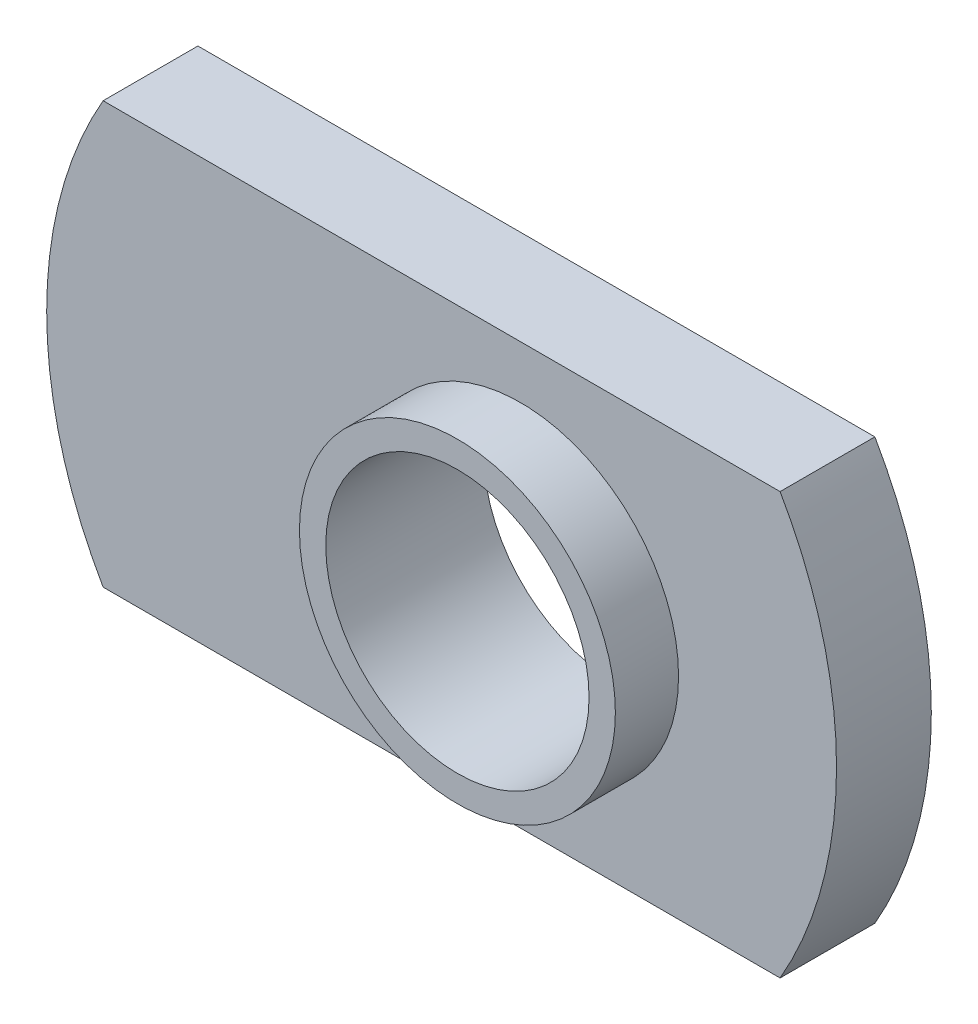
ISO-10303-21;
HEADER;
FILE_DESCRIPTION(('STEP AP214'),'2;1');
FILE_NAME('part.step','',(''),(''),'','','');
FILE_SCHEMA(('AUTOMOTIVE_DESIGN { 1 0 10303 214 1 1 1 1 }'));
ENDSEC;
DATA;
#1=APPLICATION_CONTEXT('core data for automotive mechanical design processes');
#2=APPLICATION_PROTOCOL_DEFINITION('international standard','automotive_design',2000,#1);
#3=PRODUCT_CONTEXT('',#1,'mechanical');
#4=PRODUCT('Part','Part','',(#3));
#5=PRODUCT_RELATED_PRODUCT_CATEGORY('part','',(#4));
#6=PRODUCT_DEFINITION_FORMATION('','',#4);
#7=PRODUCT_DEFINITION_CONTEXT('part definition',#1,'design');
#8=PRODUCT_DEFINITION('design','',#6,#7);
#9=PRODUCT_DEFINITION_SHAPE('','',#8);
#10=(LENGTH_UNIT() NAMED_UNIT(*) SI_UNIT(.MILLI.,.METRE.));
#11=(NAMED_UNIT(*) PLANE_ANGLE_UNIT() SI_UNIT($,.RADIAN.));
#12=(NAMED_UNIT(*) SI_UNIT($,.STERADIAN.) SOLID_ANGLE_UNIT());
#13=UNCERTAINTY_MEASURE_WITH_UNIT(LENGTH_MEASURE(1.E-05),#10,'distance_accuracy_value','');
#14=(GEOMETRIC_REPRESENTATION_CONTEXT(3) GLOBAL_UNCERTAINTY_ASSIGNED_CONTEXT((#13)) GLOBAL_UNIT_ASSIGNED_CONTEXT((#10,
#11,#12)) REPRESENTATION_CONTEXT('',''));
#15=CARTESIAN_POINT('',(0.,0.,0.));
#16=DIRECTION('',(0.,0.,1.));
#17=DIRECTION('',(1.,0.,0.));
#18=AXIS2_PLACEMENT_3D('',#15,#16,#17);
#19=CARTESIAN_POINT('',(-1.,0.,0.9));
#20=DIRECTION('',(0.,0.,-1.));
#21=DIRECTION('',(-1.,0.,0.));
#22=AXIS2_PLACEMENT_3D('',#19,#20,#21);
#23=CYLINDRICAL_SURFACE('',#22,8.);
#24=CARTESIAN_POINT('',(-1.,0.,-0.9));
#25=DIRECTION('',(0.,0.,1.));
#26=DIRECTION('',(-1.,0.,0.));
#27=AXIS2_PLACEMENT_3D('',#24,#25,#26);
#28=CIRCLE('',#27,8.);
#29=CARTESIAN_POINT('',(-7.92820323027551,4.,-0.9));
#30=VERTEX_POINT('',#29);
#31=CARTESIAN_POINT('',(-7.92820323027551,-4.,-0.9));
#32=VERTEX_POINT('',#31);
#33=EDGE_CURVE('E110',#30,#32,#28,.T.);
#34=ORIENTED_EDGE('',*,*,#33,.T.);
#35=DIRECTION('',(0.,0.,-1.));
#36=VECTOR('',#35,1.);
#37=CARTESIAN_POINT('',(-7.92820323027551,-4.,0.9));
#38=LINE('',#37,#36);
#39=CARTESIAN_POINT('',(-7.92820323027551,-4.,0.9));
#40=VERTEX_POINT('',#39);
#41=EDGE_CURVE('E48',#40,#32,#38,.T.);
#42=ORIENTED_EDGE('',*,*,#41,.F.);
#43=CARTESIAN_POINT('',(-1.,0.,0.9));
#44=DIRECTION('',(0.,0.,1.));
#45=DIRECTION('',(-1.,0.,0.));
#46=AXIS2_PLACEMENT_3D('',#43,#44,#45);
#47=CIRCLE('',#46,8.);
#48=CARTESIAN_POINT('',(-7.92820323027551,4.,0.9));
#49=VERTEX_POINT('',#48);
#50=EDGE_CURVE('E92',#49,#40,#47,.T.);
#51=ORIENTED_EDGE('',*,*,#50,.F.);
#52=DIRECTION('',(0.,0.,-1.));
#53=VECTOR('',#52,1.);
#54=CARTESIAN_POINT('',(-7.92820323027551,4.,0.9));
#55=LINE('',#54,#53);
#56=EDGE_CURVE('E106',#49,#30,#55,.T.);
#57=ORIENTED_EDGE('',*,*,#56,.T.);
#58=EDGE_LOOP('',(#34,#42,#51,#57));
#59=FACE_BOUND('',#58,.T.);
#60=ADVANCED_FACE('F39',(#59),#23,.T.);
#61=CARTESIAN_POINT('',(-7.92820323027551,-4.,0.9));
#62=DIRECTION('',(0.,1.,0.));
#63=DIRECTION('',(-1.,0.,0.));
#64=AXIS2_PLACEMENT_3D('',#61,#62,#63);
#65=PLANE('',#64);
#66=DIRECTION('',(1.,0.,0.));
#67=VECTOR('',#66,1.);
#68=CARTESIAN_POINT('',(-7.92820323027551,-4.,-0.9));
#69=LINE('',#68,#67);
#70=CARTESIAN_POINT('',(4.92820323027551,-4.,-0.9));
#71=VERTEX_POINT('',#70);
#72=EDGE_CURVE('E98',#32,#71,#69,.T.);
#73=ORIENTED_EDGE('',*,*,#72,.T.);
#74=DIRECTION('',(0.,0.,-1.));
#75=VECTOR('',#74,1.);
#76=CARTESIAN_POINT('',(4.92820323027551,-4.,0.9));
#77=LINE('',#76,#75);
#78=CARTESIAN_POINT('',(4.92820323027551,-4.,0.9));
#79=VERTEX_POINT('',#78);
#80=EDGE_CURVE('E96',#79,#71,#77,.T.);
#81=ORIENTED_EDGE('',*,*,#80,.F.);
#82=DIRECTION('',(1.,0.,0.));
#83=VECTOR('',#82,1.);
#84=CARTESIAN_POINT('',(-7.92820323027551,-4.,0.9));
#85=LINE('',#84,#83);
#86=EDGE_CURVE('E87',#40,#79,#85,.T.);
#87=ORIENTED_EDGE('',*,*,#86,.F.);
#88=ORIENTED_EDGE('',*,*,#41,.T.);
#89=EDGE_LOOP('',(#73,#81,#87,#88));
#90=FACE_BOUND('',#89,.T.);
#91=ADVANCED_FACE('F97',(#90),#65,.F.);
#92=CARTESIAN_POINT('',(-2.,0.,0.9));
#93=DIRECTION('',(0.,0.,-1.));
#94=DIRECTION('',(-1.,0.,0.));
#95=AXIS2_PLACEMENT_3D('',#92,#93,#94);
#96=CYLINDRICAL_SURFACE('',#95,8.);
#97=CARTESIAN_POINT('',(-2.,0.,-0.9));
#98=DIRECTION('',(0.,0.,1.));
#99=DIRECTION('',(1.,0.,0.));
#100=AXIS2_PLACEMENT_3D('',#97,#98,#99);
#101=CIRCLE('',#100,8.);
#102=CARTESIAN_POINT('',(4.92820323027551,4.,-0.9));
#103=VERTEX_POINT('',#102);
#104=EDGE_CURVE('E73',#71,#103,#101,.T.);
#105=ORIENTED_EDGE('',*,*,#104,.T.);
#106=DIRECTION('',(0.,0.,-1.));
#107=VECTOR('',#106,1.);
#108=CARTESIAN_POINT('',(4.92820323027551,4.,0.9));
#109=LINE('',#108,#107);
#110=CARTESIAN_POINT('',(4.92820323027551,4.,0.9));
#111=VERTEX_POINT('',#110);
#112=EDGE_CURVE('E100',#111,#103,#109,.T.);
#113=ORIENTED_EDGE('',*,*,#112,.F.);
#114=CARTESIAN_POINT('',(-2.,0.,0.9));
#115=DIRECTION('',(0.,0.,1.));
#116=DIRECTION('',(1.,0.,0.));
#117=AXIS2_PLACEMENT_3D('',#114,#115,#116);
#118=CIRCLE('',#117,8.);
#119=EDGE_CURVE('E90',#79,#111,#118,.T.);
#120=ORIENTED_EDGE('',*,*,#119,.F.);
#121=ORIENTED_EDGE('',*,*,#80,.T.);
#122=EDGE_LOOP('',(#105,#113,#120,#121));
#123=FACE_BOUND('',#122,.T.);
#124=ADVANCED_FACE('F102',(#123),#96,.T.);
#125=CARTESIAN_POINT('',(-7.92820323027551,4.,0.9));
#126=DIRECTION('',(0.,-1.,0.));
#127=DIRECTION('',(0.,0.,-1.));
#128=AXIS2_PLACEMENT_3D('',#125,#126,#127);
#129=PLANE('',#128);
#130=DIRECTION('',(-1.,0.,0.));
#131=VECTOR('',#130,1.);
#132=CARTESIAN_POINT('',(-7.92820323027551,4.,-0.9));
#133=LINE('',#132,#131);
#134=EDGE_CURVE('E79',#103,#30,#133,.T.);
#135=ORIENTED_EDGE('',*,*,#134,.T.);
#136=ORIENTED_EDGE('',*,*,#56,.F.);
#137=DIRECTION('',(-1.,0.,0.));
#138=VECTOR('',#137,1.);
#139=CARTESIAN_POINT('',(-7.92820323027551,4.,0.9));
#140=LINE('',#139,#138);
#141=EDGE_CURVE('E56',#111,#49,#140,.T.);
#142=ORIENTED_EDGE('',*,*,#141,.F.);
#143=ORIENTED_EDGE('',*,*,#112,.T.);
#144=EDGE_LOOP('',(#135,#136,#142,#143));
#145=FACE_BOUND('',#144,.T.);
#146=ADVANCED_FACE('F140',(#145),#129,.F.);
#147=CARTESIAN_POINT('',(-1.,0.,0.9));
#148=DIRECTION('',(0.,0.,-1.));
#149=DIRECTION('',(-1.,0.,0.));
#150=AXIS2_PLACEMENT_3D('',#147,#148,#149);
#151=PLANE('',#150);
#152=CARTESIAN_POINT('',(0.,0.,0.9));
#153=DIRECTION('',(0.,0.,-1.));
#154=DIRECTION('',(-1.,0.,0.));
#155=AXIS2_PLACEMENT_3D('',#152,#153,#154);
#156=CIRCLE('',#155,3.);
#157=CARTESIAN_POINT('',(-3.,0.,0.9));
#158=VERTEX_POINT('',#157);
#159=EDGE_CURVE('E11',#158,#158,#156,.F.);
#160=ORIENTED_EDGE('',*,*,#159,.F.);
#161=EDGE_LOOP('',(#160));
#162=FACE_BOUND('',#161,.T.);
#163=ORIENTED_EDGE('',*,*,#50,.T.);
#164=ORIENTED_EDGE('',*,*,#86,.T.);
#165=ORIENTED_EDGE('',*,*,#119,.T.);
#166=ORIENTED_EDGE('',*,*,#141,.T.);
#167=EDGE_LOOP('',(#163,#164,#165,#166));
#168=FACE_BOUND('',#167,.T.);
#169=ADVANCED_FACE('F88',(#162,#168),#151,.F.);
#170=CARTESIAN_POINT('',(-1.,0.,-0.9));
#171=DIRECTION('',(0.,0.,-1.));
#172=DIRECTION('',(-1.,0.,0.));
#173=AXIS2_PLACEMENT_3D('',#170,#171,#172);
#174=PLANE('',#173);
#175=CARTESIAN_POINT('',(0.,0.,-0.9));
#176=DIRECTION('',(0.,0.,1.));
#177=DIRECTION('',(1.,0.,0.));
#178=AXIS2_PLACEMENT_3D('',#175,#176,#177);
#179=CIRCLE('',#178,2.5);
#180=CARTESIAN_POINT('',(2.5,0.,-0.9));
#181=VERTEX_POINT('',#180);
#182=EDGE_CURVE('E203',#181,#181,#179,.T.);
#183=ORIENTED_EDGE('',*,*,#182,.T.);
#184=EDGE_LOOP('',(#183));
#185=FACE_BOUND('',#184,.T.);
#186=ORIENTED_EDGE('',*,*,#33,.F.);
#187=ORIENTED_EDGE('',*,*,#134,.F.);
#188=ORIENTED_EDGE('',*,*,#104,.F.);
#189=ORIENTED_EDGE('',*,*,#72,.F.);
#190=EDGE_LOOP('',(#186,#187,#188,#189));
#191=FACE_BOUND('',#190,.T.);
#192=ADVANCED_FACE('F128',(#185,#191),#174,.T.);
#193=CARTESIAN_POINT('',(0.,0.,2.1));
#194=DIRECTION('',(0.,0.,1.));
#195=DIRECTION('',(1.,0.,0.));
#196=AXIS2_PLACEMENT_3D('',#193,#194,#195);
#197=PLANE('',#196);
#198=CARTESIAN_POINT('',(0.,0.,2.1));
#199=DIRECTION('',(0.,0.,1.));
#200=DIRECTION('',(1.,0.,0.));
#201=AXIS2_PLACEMENT_3D('',#198,#199,#200);
#202=CIRCLE('',#201,3.);
#203=CARTESIAN_POINT('',(3.,0.,2.1));
#204=VERTEX_POINT('',#203);
#205=EDGE_CURVE('E114',#204,#204,#202,.T.);
#206=ORIENTED_EDGE('',*,*,#205,.T.);
#207=EDGE_LOOP('',(#206));
#208=FACE_BOUND('',#207,.T.);
#209=CARTESIAN_POINT('',(0.,0.,2.1));
#210=DIRECTION('',(0.,0.,1.));
#211=DIRECTION('',(1.,0.,0.));
#212=AXIS2_PLACEMENT_3D('',#209,#210,#211);
#213=CIRCLE('',#212,2.5);
#214=CARTESIAN_POINT('',(2.5,0.,2.1));
#215=VERTEX_POINT('',#214);
#216=EDGE_CURVE('E201',#215,#215,#213,.T.);
#217=ORIENTED_EDGE('',*,*,#216,.F.);
#218=EDGE_LOOP('',(#217));
#219=FACE_BOUND('',#218,.T.);
#220=ADVANCED_FACE('F130',(#208,#219),#197,.T.);
#221=CARTESIAN_POINT('',(0.,0.,2.1));
#222=DIRECTION('',(0.,0.,-1.));
#223=DIRECTION('',(-1.,0.,0.));
#224=AXIS2_PLACEMENT_3D('',#221,#222,#223);
#225=CYLINDRICAL_SURFACE('',#224,3.);
#226=ORIENTED_EDGE('',*,*,#205,.F.);
#227=EDGE_LOOP('',(#226));
#228=FACE_BOUND('',#227,.T.);
#229=ORIENTED_EDGE('',*,*,#159,.T.);
#230=EDGE_LOOP('',(#229));
#231=FACE_BOUND('',#230,.T.);
#232=ADVANCED_FACE('F137',(#228,#231),#225,.T.);
#233=CARTESIAN_POINT('',(0.,0.,2.1));
#234=DIRECTION('',(0.,0.,-1.));
#235=DIRECTION('',(-1.,0.,0.));
#236=AXIS2_PLACEMENT_3D('',#233,#234,#235);
#237=CYLINDRICAL_SURFACE('',#236,2.5);
#238=ORIENTED_EDGE('',*,*,#216,.T.);
#239=EDGE_LOOP('',(#238));
#240=FACE_BOUND('',#239,.T.);
#241=ORIENTED_EDGE('',*,*,#182,.F.);
#242=EDGE_LOOP('',(#241));
#243=FACE_BOUND('',#242,.T.);
#244=ADVANCED_FACE('F177',(#240,#243),#237,.F.);
#245=CLOSED_SHELL('',(#60,#91,#124,#146,#169,#192,#220,#232,#244));
#246=MANIFOLD_SOLID_BREP('B2',#245);
#247=ADVANCED_BREP_SHAPE_REPRESENTATION('',(#18,#246),#14);
#248=SHAPE_DEFINITION_REPRESENTATION(#9,#247);
ENDSEC;
END-ISO-10303-21;
